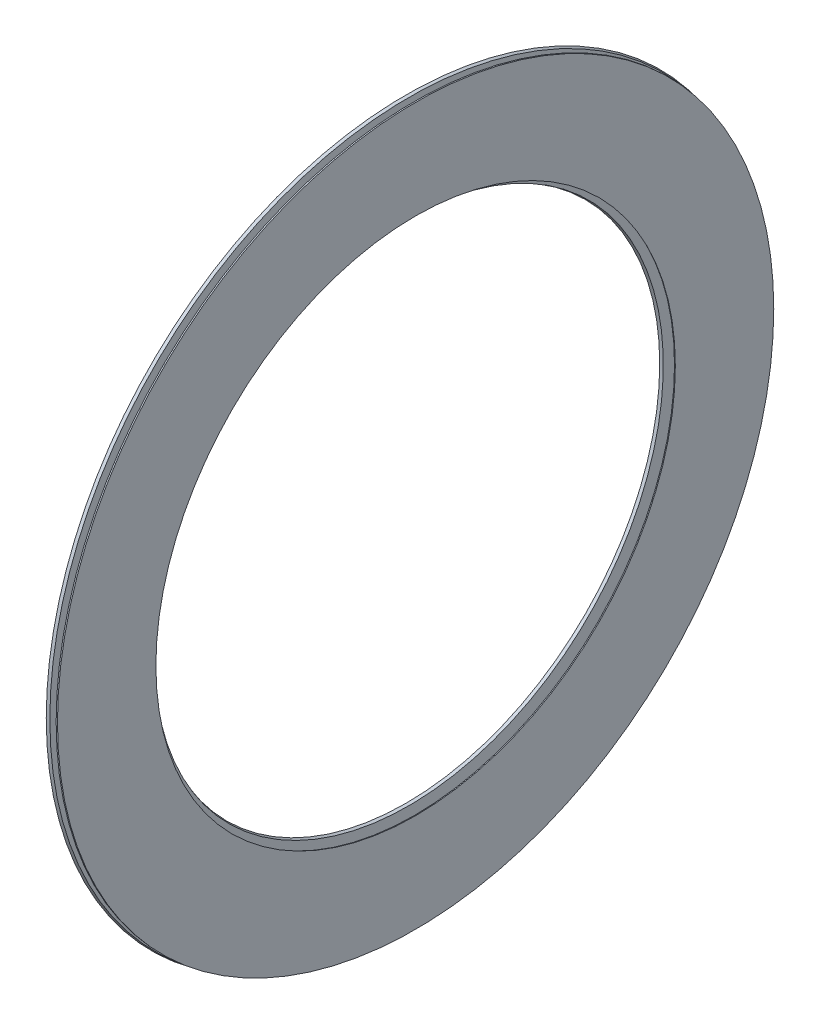
ISO-10303-21;
HEADER;
FILE_DESCRIPTION(('STEP AP214'),'2;1');
FILE_NAME('part.step','',(''),(''),'','','');
FILE_SCHEMA(('AUTOMOTIVE_DESIGN { 1 0 10303 214 1 1 1 1 }'));
ENDSEC;
DATA;
#1=APPLICATION_CONTEXT('core data for automotive mechanical design processes');
#2=APPLICATION_PROTOCOL_DEFINITION('international standard','automotive_design',2000,#1);
#3=PRODUCT_CONTEXT('',#1,'mechanical');
#4=PRODUCT('Part','Part','',(#3));
#5=PRODUCT_RELATED_PRODUCT_CATEGORY('part','',(#4));
#6=PRODUCT_DEFINITION_FORMATION('','',#4);
#7=PRODUCT_DEFINITION_CONTEXT('part definition',#1,'design');
#8=PRODUCT_DEFINITION('design','',#6,#7);
#9=PRODUCT_DEFINITION_SHAPE('','',#8);
#10=(LENGTH_UNIT() NAMED_UNIT(*) SI_UNIT(.MILLI.,.METRE.));
#11=(NAMED_UNIT(*) PLANE_ANGLE_UNIT() SI_UNIT($,.RADIAN.));
#12=(NAMED_UNIT(*) SI_UNIT($,.STERADIAN.) SOLID_ANGLE_UNIT());
#13=UNCERTAINTY_MEASURE_WITH_UNIT(LENGTH_MEASURE(1.E-05),#10,'distance_accuracy_value','');
#14=(GEOMETRIC_REPRESENTATION_CONTEXT(3) GLOBAL_UNCERTAINTY_ASSIGNED_CONTEXT((#13)) GLOBAL_UNIT_ASSIGNED_CONTEXT((#10,
#11,#12)) REPRESENTATION_CONTEXT('',''));
#15=CARTESIAN_POINT('',(0.,0.,0.));
#16=DIRECTION('',(0.,0.,1.));
#17=DIRECTION('',(1.,0.,0.));
#18=AXIS2_PLACEMENT_3D('',#15,#16,#17);
#19=CARTESIAN_POINT('',(-1.698125,0.,0.));
#20=DIRECTION('',(1.,0.,0.));
#21=DIRECTION('',(0.,0.,1.));
#22=AXIS2_PLACEMENT_3D('',#19,#20,#21);
#23=CONICAL_SURFACE('',#22,22.65537715,0.0450926803674557);
#24=CARTESIAN_POINT('',(-3.39625,0.,0.));
#25=DIRECTION('',(-1.,0.,0.));
#26=DIRECTION('',(0.,0.,1.));
#27=AXIS2_PLACEMENT_3D('',#24,#25,#26);
#28=CIRCLE('',#27,22.5787522);
#29=CARTESIAN_POINT('',(-3.39625,0.,22.5787522));
#30=VERTEX_POINT('',#29);
#31=EDGE_CURVE('E11',#30,#30,#28,.T.);
#32=ORIENTED_EDGE('',*,*,#31,.F.);
#33=EDGE_LOOP('',(#32));
#34=FACE_BOUND('',#33,.T.);
#35=CARTESIAN_POINT('',(-3.31,0.,0.));
#36=DIRECTION('',(1.,0.,0.));
#37=DIRECTION('',(0.,0.,1.));
#38=AXIS2_PLACEMENT_3D('',#35,#36,#37);
#39=CIRCLE('',#38,22.5826440818918);
#40=CARTESIAN_POINT('',(-3.31,0.,-22.5826440818918));
#41=VERTEX_POINT('',#40);
#42=EDGE_CURVE('E26',#41,#41,#39,.T.);
#43=ORIENTED_EDGE('',*,*,#42,.F.);
#44=EDGE_LOOP('',(#43));
#45=FACE_BOUND('',#44,.T.);
#46=ADVANCED_FACE('F16',(#34,#45),#23,.T.);
#47=CARTESIAN_POINT('',(-3.39625,0.,19.3405001));
#48=DIRECTION('',(-1.,0.,0.));
#49=DIRECTION('',(0.,0.,-1.));
#50=AXIS2_PLACEMENT_3D('',#47,#48,#49);
#51=PLANE('',#50);
#52=ORIENTED_EDGE('',*,*,#31,.T.);
#53=EDGE_LOOP('',(#52));
#54=FACE_BOUND('',#53,.T.);
#55=CARTESIAN_POINT('',(-3.39625,0.,0.));
#56=DIRECTION('',(1.,0.,0.));
#57=DIRECTION('',(0.,0.,1.));
#58=AXIS2_PLACEMENT_3D('',#55,#56,#57);
#59=CIRCLE('',#58,16.41135);
#60=CARTESIAN_POINT('',(-3.39625,0.,16.41135));
#61=VERTEX_POINT('',#60);
#62=EDGE_CURVE('E61',#61,#61,#59,.T.);
#63=ORIENTED_EDGE('',*,*,#62,.T.);
#64=EDGE_LOOP('',(#63));
#65=FACE_BOUND('',#64,.T.);
#66=ADVANCED_FACE('F76',(#54,#65),#51,.T.);
#67=CARTESIAN_POINT('',(-3.31,0.,19.3405001));
#68=DIRECTION('',(1.,0.,0.));
#69=DIRECTION('',(0.,0.,1.));
#70=AXIS2_PLACEMENT_3D('',#67,#68,#69);
#71=PLANE('',#70);
#72=ORIENTED_EDGE('',*,*,#42,.T.);
#73=EDGE_LOOP('',(#72));
#74=FACE_BOUND('',#73,.T.);
#75=CARTESIAN_POINT('',(-3.31,0.,0.));
#76=DIRECTION('',(-1.,0.,0.));
#77=DIRECTION('',(0.,0.,1.));
#78=AXIS2_PLACEMENT_3D('',#75,#76,#77);
#79=CIRCLE('',#78,16.3763892120002);
#80=CARTESIAN_POINT('',(-3.31,0.,-16.3763892120002));
#81=VERTEX_POINT('',#80);
#82=EDGE_CURVE('E54',#81,#81,#79,.T.);
#83=ORIENTED_EDGE('',*,*,#82,.T.);
#84=EDGE_LOOP('',(#83));
#85=FACE_BOUND('',#84,.T.);
#86=ADVANCED_FACE('F65',(#74,#85),#71,.T.);
#87=CARTESIAN_POINT('',(-3.23527500998457,0.,0.));
#88=DIRECTION('',(-1.,0.,0.));
#89=DIRECTION('',(0.,0.,1.));
#90=AXIS2_PLACEMENT_3D('',#87,#88,#89);
#91=CONICAL_SURFACE('',#90,16.3461000000092,0.385103453003653);
#92=ORIENTED_EDGE('',*,*,#62,.F.);
#93=EDGE_LOOP('',(#92));
#94=FACE_BOUND('',#93,.T.);
#95=ORIENTED_EDGE('',*,*,#82,.F.);
#96=EDGE_LOOP('',(#95));
#97=FACE_BOUND('',#96,.T.);
#98=ADVANCED_FACE('F67',(#94,#97),#91,.F.);
#99=CLOSED_SHELL('',(#46,#66,#86,#98));
#100=MANIFOLD_SOLID_BREP('B1',#99);
#101=CARTESIAN_POINT('',(-3.870625,0.,0.));
#102=DIRECTION('',(1.,0.,0.));
#103=DIRECTION('',(0.,0.,1.));
#104=AXIS2_PLACEMENT_3D('',#101,#102,#103);
#105=CONICAL_SURFACE('',#104,16.01025,0.301266639932819);
#106=CARTESIAN_POINT('',(-3.74125,0.,0.));
#107=DIRECTION('',(-1.,0.,0.));
#108=DIRECTION('',(0.,0.,1.));
#109=AXIS2_PLACEMENT_3D('',#106,#107,#108);
#110=CIRCLE('',#109,16.05045);
#111=CARTESIAN_POINT('',(-3.74125,0.,16.05045));
#112=VERTEX_POINT('',#111);
#113=EDGE_CURVE('E56',#112,#112,#110,.T.);
#114=ORIENTED_EDGE('',*,*,#113,.F.);
#115=EDGE_LOOP('',(#114));
#116=FACE_BOUND('',#115,.T.);
#117=CARTESIAN_POINT('',(-3.91375,0.,0.));
#118=DIRECTION('',(1.,0.,0.));
#119=DIRECTION('',(0.,0.,1.));
#120=AXIS2_PLACEMENT_3D('',#117,#118,#119);
#121=CIRCLE('',#120,15.99685);
#122=CARTESIAN_POINT('',(-3.91375,0.,-15.99685));
#123=VERTEX_POINT('',#122);
#124=EDGE_CURVE('E50',#123,#123,#121,.T.);
#125=ORIENTED_EDGE('',*,*,#124,.F.);
#126=EDGE_LOOP('',(#125));
#127=FACE_BOUND('',#126,.T.);
#128=ADVANCED_FACE('F18',(#116,#127),#105,.F.);
#129=CARTESIAN_POINT('',(-3.784375,0.,0.));
#130=DIRECTION('',(-1.,0.,0.));
#131=DIRECTION('',(0.,0.,1.));
#132=AXIS2_PLACEMENT_3D('',#129,#130,#131);
#133=CONICAL_SURFACE('',#132,22.6457521,0.301266216998826);
#134=CARTESIAN_POINT('',(-3.91375,0.,0.));
#135=DIRECTION('',(-1.,0.,0.));
#136=DIRECTION('',(0.,0.,1.));
#137=AXIS2_PLACEMENT_3D('',#134,#135,#136);
#138=CIRCLE('',#137,22.68595204);
#139=CARTESIAN_POINT('',(-3.91375,0.,-22.68595204));
#140=VERTEX_POINT('',#139);
#141=EDGE_CURVE('E53',#140,#140,#138,.T.);
#142=ORIENTED_EDGE('',*,*,#141,.F.);
#143=EDGE_LOOP('',(#142));
#144=FACE_BOUND('',#143,.T.);
#145=CARTESIAN_POINT('',(-3.74125,0.,0.));
#146=DIRECTION('',(1.,0.,0.));
#147=DIRECTION('',(0.,0.,1.));
#148=AXIS2_PLACEMENT_3D('',#145,#146,#147);
#149=CIRCLE('',#148,22.63235212);
#150=CARTESIAN_POINT('',(-3.74125,0.,-22.63235212));
#151=VERTEX_POINT('',#150);
#152=EDGE_CURVE('E20',#151,#151,#149,.T.);
#153=ORIENTED_EDGE('',*,*,#152,.F.);
#154=EDGE_LOOP('',(#153));
#155=FACE_BOUND('',#154,.T.);
#156=ADVANCED_FACE('F90',(#144,#155),#133,.T.);
#157=CARTESIAN_POINT('',(-3.91375,0.,19.3405001));
#158=DIRECTION('',(-1.,0.,0.));
#159=DIRECTION('',(0.,0.,-1.));
#160=AXIS2_PLACEMENT_3D('',#157,#158,#159);
#161=PLANE('',#160);
#162=ORIENTED_EDGE('',*,*,#141,.T.);
#163=EDGE_LOOP('',(#162));
#164=FACE_BOUND('',#163,.T.);
#165=ORIENTED_EDGE('',*,*,#124,.T.);
#166=EDGE_LOOP('',(#165));
#167=FACE_BOUND('',#166,.T.);
#168=ADVANCED_FACE('F51',(#164,#167),#161,.T.);
#169=CARTESIAN_POINT('',(-3.74125,0.,19.3405001));
#170=DIRECTION('',(1.,0.,0.));
#171=DIRECTION('',(0.,0.,1.));
#172=AXIS2_PLACEMENT_3D('',#169,#170,#171);
#173=PLANE('',#172);
#174=ORIENTED_EDGE('',*,*,#152,.T.);
#175=EDGE_LOOP('',(#174));
#176=FACE_BOUND('',#175,.T.);
#177=ORIENTED_EDGE('',*,*,#113,.T.);
#178=EDGE_LOOP('',(#177));
#179=FACE_BOUND('',#178,.T.);
#180=ADVANCED_FACE('F95',(#176,#179),#173,.T.);
#181=CLOSED_SHELL('',(#128,#156,#168,#180));
#182=MANIFOLD_SOLID_BREP('B1',#181);
#183=ADVANCED_BREP_SHAPE_REPRESENTATION('',(#18,#100,#182),#14);
#184=SHAPE_DEFINITION_REPRESENTATION(#9,#183);
ENDSEC;
END-ISO-10303-21;
